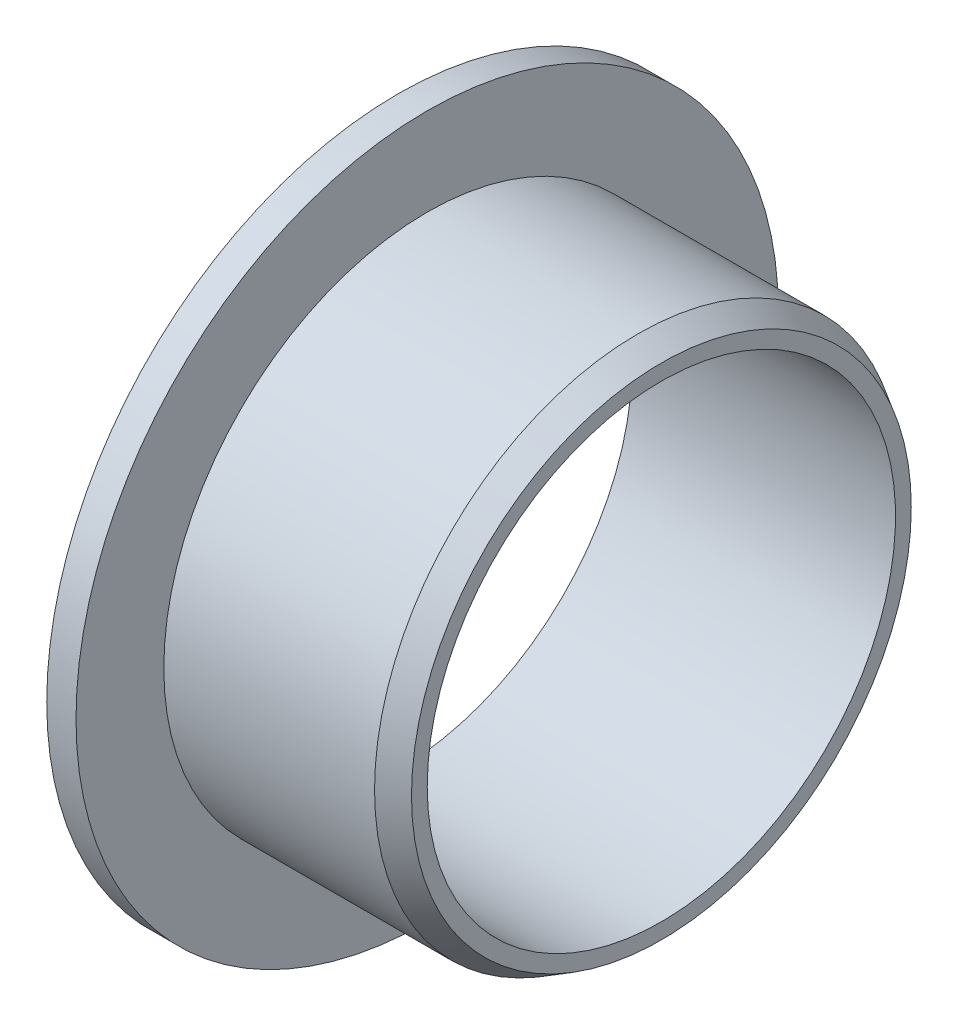
ISO-10303-21;
HEADER;
FILE_DESCRIPTION(('STEP AP214'),'2;1');
FILE_NAME('part.step','',(''),(''),'','','');
FILE_SCHEMA(('AUTOMOTIVE_DESIGN { 1 0 10303 214 1 1 1 1 }'));
ENDSEC;
DATA;
#1=APPLICATION_CONTEXT('core data for automotive mechanical design processes');
#2=APPLICATION_PROTOCOL_DEFINITION('international standard','automotive_design',2000,#1);
#3=PRODUCT_CONTEXT('',#1,'mechanical');
#4=PRODUCT('Part','Part','',(#3));
#5=PRODUCT_RELATED_PRODUCT_CATEGORY('part','',(#4));
#6=PRODUCT_DEFINITION_FORMATION('','',#4);
#7=PRODUCT_DEFINITION_CONTEXT('part definition',#1,'design');
#8=PRODUCT_DEFINITION('design','',#6,#7);
#9=PRODUCT_DEFINITION_SHAPE('','',#8);
#10=(LENGTH_UNIT() NAMED_UNIT(*) SI_UNIT(.MILLI.,.METRE.));
#11=(NAMED_UNIT(*) PLANE_ANGLE_UNIT() SI_UNIT($,.RADIAN.));
#12=(NAMED_UNIT(*) SI_UNIT($,.STERADIAN.) SOLID_ANGLE_UNIT());
#13=UNCERTAINTY_MEASURE_WITH_UNIT(LENGTH_MEASURE(1.E-05),#10,'distance_accuracy_value','');
#14=(GEOMETRIC_REPRESENTATION_CONTEXT(3) GLOBAL_UNCERTAINTY_ASSIGNED_CONTEXT((#13)) GLOBAL_UNIT_ASSIGNED_CONTEXT((#10,
#11,#12)) REPRESENTATION_CONTEXT('',''));
#15=CARTESIAN_POINT('',(0.,0.,0.));
#16=DIRECTION('',(0.,0.,1.));
#17=DIRECTION('',(1.,0.,0.));
#18=AXIS2_PLACEMENT_3D('',#15,#16,#17);
#19=CARTESIAN_POINT('',(0.,8.,0.));
#20=DIRECTION('',(1.,0.,0.));
#21=DIRECTION('',(0.,0.,-1.));
#22=AXIS2_PLACEMENT_3D('',#19,#20,#21);
#23=PLANE('',#22);
#24=CARTESIAN_POINT('',(0.,0.,0.));
#25=DIRECTION('',(-1.,0.,0.));
#26=DIRECTION('',(0.,0.,1.));
#27=AXIS2_PLACEMENT_3D('',#24,#25,#26);
#28=CIRCLE('',#27,8.);
#29=CARTESIAN_POINT('',(0.,0.,8.));
#30=VERTEX_POINT('',#29);
#31=EDGE_CURVE('E72',#30,#30,#28,.T.);
#32=ORIENTED_EDGE('',*,*,#31,.F.);
#33=EDGE_LOOP('',(#32));
#34=FACE_BOUND('',#33,.T.);
#35=CARTESIAN_POINT('',(0.,0.,0.));
#36=DIRECTION('',(-1.,0.,0.));
#37=DIRECTION('',(0.,0.,1.));
#38=AXIS2_PLACEMENT_3D('',#35,#36,#37);
#39=CIRCLE('',#38,12.);
#40=CARTESIAN_POINT('',(0.,0.,12.));
#41=VERTEX_POINT('',#40);
#42=EDGE_CURVE('E53',#41,#41,#39,.T.);
#43=ORIENTED_EDGE('',*,*,#42,.T.);
#44=EDGE_LOOP('',(#43));
#45=FACE_BOUND('',#44,.T.);
#46=ADVANCED_FACE('F39',(#34,#45),#23,.F.);
#47=CARTESIAN_POINT('',(0.,0.,0.));
#48=DIRECTION('',(-1.,0.,0.));
#49=DIRECTION('',(0.,0.,1.));
#50=AXIS2_PLACEMENT_3D('',#47,#48,#49);
#51=CYLINDRICAL_SURFACE('',#50,12.);
#52=ORIENTED_EDGE('',*,*,#42,.F.);
#53=EDGE_LOOP('',(#52));
#54=FACE_BOUND('',#53,.T.);
#55=CARTESIAN_POINT('',(1.,0.,0.));
#56=DIRECTION('',(-1.,0.,0.));
#57=DIRECTION('',(0.,0.,1.));
#58=AXIS2_PLACEMENT_3D('',#55,#56,#57);
#59=CIRCLE('',#58,12.);
#60=CARTESIAN_POINT('',(1.,0.,12.));
#61=VERTEX_POINT('',#60);
#62=EDGE_CURVE('E58',#61,#61,#59,.T.);
#63=ORIENTED_EDGE('',*,*,#62,.T.);
#64=EDGE_LOOP('',(#63));
#65=FACE_BOUND('',#64,.T.);
#66=ADVANCED_FACE('F81',(#54,#65),#51,.T.);
#67=CARTESIAN_POINT('',(1.,12.,0.));
#68=DIRECTION('',(-1.,0.,0.));
#69=DIRECTION('',(0.,0.,1.));
#70=AXIS2_PLACEMENT_3D('',#67,#68,#69);
#71=PLANE('',#70);
#72=ORIENTED_EDGE('',*,*,#62,.F.);
#73=EDGE_LOOP('',(#72));
#74=FACE_BOUND('',#73,.T.);
#75=CARTESIAN_POINT('',(1.,0.,0.));
#76=DIRECTION('',(-1.,0.,0.));
#77=DIRECTION('',(0.,0.,1.));
#78=AXIS2_PLACEMENT_3D('',#75,#76,#77);
#79=CIRCLE('',#78,9.);
#80=CARTESIAN_POINT('',(1.,0.,9.));
#81=VERTEX_POINT('',#80);
#82=EDGE_CURVE('E64',#81,#81,#79,.T.);
#83=ORIENTED_EDGE('',*,*,#82,.T.);
#84=EDGE_LOOP('',(#83));
#85=FACE_BOUND('',#84,.T.);
#86=ADVANCED_FACE('F86',(#74,#85),#71,.F.);
#87=CARTESIAN_POINT('',(0.,0.,0.));
#88=DIRECTION('',(-1.,0.,0.));
#89=DIRECTION('',(0.,0.,1.));
#90=AXIS2_PLACEMENT_3D('',#87,#88,#89);
#91=CYLINDRICAL_SURFACE('',#90,9.);
#92=CARTESIAN_POINT('',(8.19999999999999,0.,0.));
#93=DIRECTION('',(-1.,0.,0.));
#94=DIRECTION('',(0.,0.,1.));
#95=AXIS2_PLACEMENT_3D('',#92,#93,#94);
#96=CIRCLE('',#95,9.);
#97=CARTESIAN_POINT('',(8.19999999999999,0.,9.));
#98=VERTEX_POINT('',#97);
#99=EDGE_CURVE('E48',#98,#98,#96,.T.);
#100=ORIENTED_EDGE('',*,*,#99,.T.);
#101=EDGE_LOOP('',(#100));
#102=FACE_BOUND('',#101,.T.);
#103=ORIENTED_EDGE('',*,*,#82,.F.);
#104=EDGE_LOOP('',(#103));
#105=FACE_BOUND('',#104,.T.);
#106=ADVANCED_FACE('F92',(#102,#105),#91,.T.);
#107=CARTESIAN_POINT('',(9.,8.,0.));
#108=DIRECTION('',(-1.,0.,0.));
#109=DIRECTION('',(0.,0.,1.));
#110=AXIS2_PLACEMENT_3D('',#107,#108,#109);
#111=PLANE('',#110);
#112=CARTESIAN_POINT('',(9.,0.,0.));
#113=DIRECTION('',(-1.,0.,0.));
#114=DIRECTION('',(0.,0.,1.));
#115=AXIS2_PLACEMENT_3D('',#112,#113,#114);
#116=CIRCLE('',#115,8.5381197846483);
#117=CARTESIAN_POINT('',(9.,0.,8.5381197846483));
#118=VERTEX_POINT('',#117);
#119=EDGE_CURVE('E10',#118,#118,#116,.F.);
#120=ORIENTED_EDGE('',*,*,#119,.T.);
#121=EDGE_LOOP('',(#120));
#122=FACE_BOUND('',#121,.T.);
#123=CARTESIAN_POINT('',(9.,0.,0.));
#124=DIRECTION('',(-1.,0.,0.));
#125=DIRECTION('',(0.,0.,1.));
#126=AXIS2_PLACEMENT_3D('',#123,#124,#125);
#127=CIRCLE('',#126,8.);
#128=CARTESIAN_POINT('',(9.,0.,8.));
#129=VERTEX_POINT('',#128);
#130=EDGE_CURVE('E68',#129,#129,#127,.T.);
#131=ORIENTED_EDGE('',*,*,#130,.T.);
#132=EDGE_LOOP('',(#131));
#133=FACE_BOUND('',#132,.T.);
#134=ADVANCED_FACE('F97',(#122,#133),#111,.F.);
#135=CARTESIAN_POINT('',(0.,0.,0.));
#136=DIRECTION('',(-1.,0.,0.));
#137=DIRECTION('',(0.,0.,1.));
#138=AXIS2_PLACEMENT_3D('',#135,#136,#137);
#139=CYLINDRICAL_SURFACE('',#138,8.);
#140=ORIENTED_EDGE('',*,*,#130,.F.);
#141=EDGE_LOOP('',(#140));
#142=FACE_BOUND('',#141,.T.);
#143=ORIENTED_EDGE('',*,*,#31,.T.);
#144=EDGE_LOOP('',(#143));
#145=FACE_BOUND('',#144,.T.);
#146=ADVANCED_FACE('F77',(#142,#145),#139,.F.);
#147=CARTESIAN_POINT('',(8.19999999999999,0.,0.));
#148=DIRECTION('',(-1.,0.,0.));
#149=DIRECTION('',(0.,0.,1.));
#150=AXIS2_PLACEMENT_3D('',#147,#148,#149);
#151=CONICAL_SURFACE('',#150,9.,0.523598775598292);
#152=ORIENTED_EDGE('',*,*,#119,.F.);
#153=EDGE_LOOP('',(#152));
#154=FACE_BOUND('',#153,.T.);
#155=ORIENTED_EDGE('',*,*,#99,.F.);
#156=EDGE_LOOP('',(#155));
#157=FACE_BOUND('',#156,.T.);
#158=ADVANCED_FACE('F42',(#154,#157),#151,.T.);
#159=CLOSED_SHELL('',(#46,#66,#86,#106,#134,#146,#158));
#160=MANIFOLD_SOLID_BREP('B2',#159);
#161=ADVANCED_BREP_SHAPE_REPRESENTATION('',(#18,#160),#14);
#162=SHAPE_DEFINITION_REPRESENTATION(#9,#161);
ENDSEC;
END-ISO-10303-21;
